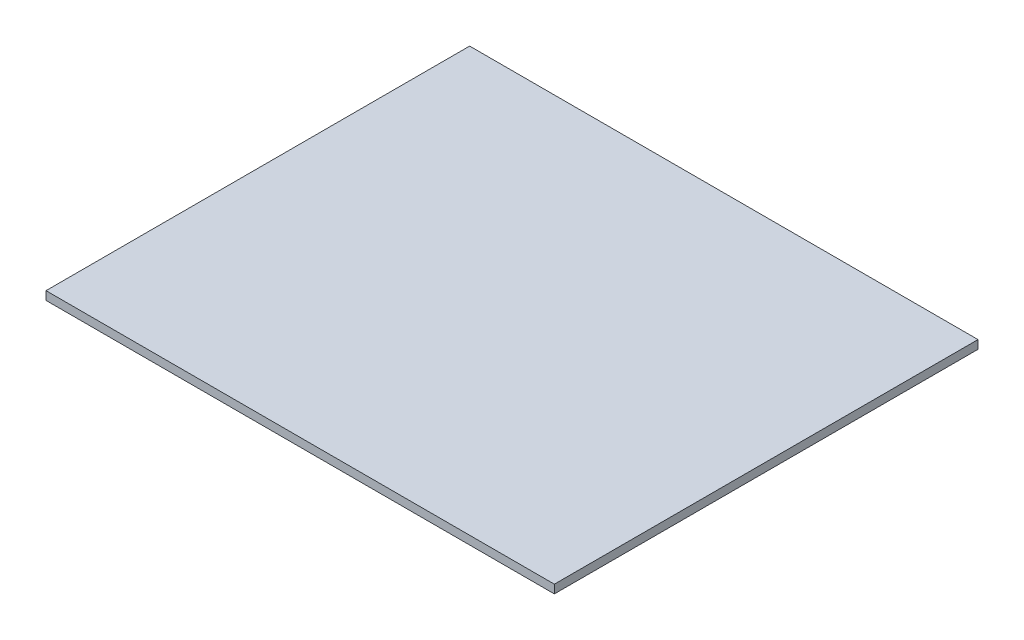
ISO-10303-21;
HEADER;
FILE_DESCRIPTION(('STEP AP214'),'2;1');
FILE_NAME('part.step','',(''),(''),'','','');
FILE_SCHEMA(('AUTOMOTIVE_DESIGN { 1 0 10303 214 1 1 1 1 }'));
ENDSEC;
DATA;
#1=APPLICATION_CONTEXT('core data for automotive mechanical design processes');
#2=APPLICATION_PROTOCOL_DEFINITION('international standard','automotive_design',2000,#1);
#3=PRODUCT_CONTEXT('',#1,'mechanical');
#4=PRODUCT('Part','Part','',(#3));
#5=PRODUCT_RELATED_PRODUCT_CATEGORY('part','',(#4));
#6=PRODUCT_DEFINITION_FORMATION('','',#4);
#7=PRODUCT_DEFINITION_CONTEXT('part definition',#1,'design');
#8=PRODUCT_DEFINITION('design','',#6,#7);
#9=PRODUCT_DEFINITION_SHAPE('','',#8);
#10=(LENGTH_UNIT() NAMED_UNIT(*) SI_UNIT(.MILLI.,.METRE.));
#11=(NAMED_UNIT(*) PLANE_ANGLE_UNIT() SI_UNIT($,.RADIAN.));
#12=(NAMED_UNIT(*) SI_UNIT($,.STERADIAN.) SOLID_ANGLE_UNIT());
#13=UNCERTAINTY_MEASURE_WITH_UNIT(LENGTH_MEASURE(1.E-05),#10,'distance_accuracy_value','');
#14=(GEOMETRIC_REPRESENTATION_CONTEXT(3) GLOBAL_UNCERTAINTY_ASSIGNED_CONTEXT((#13)) GLOBAL_UNIT_ASSIGNED_CONTEXT((#10,
#11,#12)) REPRESENTATION_CONTEXT('',''));
#15=CARTESIAN_POINT('',(0.,0.,0.));
#16=DIRECTION('',(0.,0.,1.));
#17=DIRECTION('',(1.,0.,0.));
#18=AXIS2_PLACEMENT_3D('',#15,#16,#17);
#19=CARTESIAN_POINT('',(0.,20.,1000.));
#20=DIRECTION('',(1.,0.,0.));
#21=DIRECTION('',(0.,0.,-1.));
#22=AXIS2_PLACEMENT_3D('',#19,#20,#21);
#23=PLANE('',#22);
#24=DIRECTION('',(0.,0.,1.));
#25=VECTOR('',#24,1.);
#26=CARTESIAN_POINT('',(0.,0.,1000.));
#27=LINE('',#26,#25);
#28=CARTESIAN_POINT('',(0.,0.,0.));
#29=VERTEX_POINT('',#28);
#30=CARTESIAN_POINT('',(0.,0.,1000.));
#31=VERTEX_POINT('',#30);
#32=EDGE_CURVE('E99',#29,#31,#27,.T.);
#33=ORIENTED_EDGE('',*,*,#32,.T.);
#34=DIRECTION('',(0.,-1.,0.));
#35=VECTOR('',#34,1.);
#36=CARTESIAN_POINT('',(0.,20.,1000.));
#37=LINE('',#36,#35);
#38=CARTESIAN_POINT('',(0.,20.,1000.));
#39=VERTEX_POINT('',#38);
#40=EDGE_CURVE('E11',#39,#31,#37,.T.);
#41=ORIENTED_EDGE('',*,*,#40,.F.);
#42=DIRECTION('',(0.,0.,1.));
#43=VECTOR('',#42,1.);
#44=CARTESIAN_POINT('',(0.,20.,1000.));
#45=LINE('',#44,#43);
#46=CARTESIAN_POINT('',(0.,20.,0.));
#47=VERTEX_POINT('',#46);
#48=EDGE_CURVE('E87',#47,#39,#45,.T.);
#49=ORIENTED_EDGE('',*,*,#48,.F.);
#50=DIRECTION('',(0.,-1.,0.));
#51=VECTOR('',#50,1.);
#52=CARTESIAN_POINT('',(0.,20.,0.));
#53=LINE('',#52,#51);
#54=EDGE_CURVE('E95',#47,#29,#53,.T.);
#55=ORIENTED_EDGE('',*,*,#54,.T.);
#56=EDGE_LOOP('',(#33,#41,#49,#55));
#57=FACE_BOUND('',#56,.T.);
#58=ADVANCED_FACE('F36',(#57),#23,.F.);
#59=CARTESIAN_POINT('',(1200.,20.,1000.));
#60=DIRECTION('',(0.,0.,-1.));
#61=DIRECTION('',(-1.,0.,0.));
#62=AXIS2_PLACEMENT_3D('',#59,#60,#61);
#63=PLANE('',#62);
#64=DIRECTION('',(1.,0.,0.));
#65=VECTOR('',#64,1.);
#66=CARTESIAN_POINT('',(1200.,0.,1000.));
#67=LINE('',#66,#65);
#68=CARTESIAN_POINT('',(1200.,0.,1000.));
#69=VERTEX_POINT('',#68);
#70=EDGE_CURVE('E91',#31,#69,#67,.T.);
#71=ORIENTED_EDGE('',*,*,#70,.T.);
#72=DIRECTION('',(0.,-1.,0.));
#73=VECTOR('',#72,1.);
#74=CARTESIAN_POINT('',(1200.,20.,1000.));
#75=LINE('',#74,#73);
#76=CARTESIAN_POINT('',(1200.,20.,1000.));
#77=VERTEX_POINT('',#76);
#78=EDGE_CURVE('E44',#77,#69,#75,.T.);
#79=ORIENTED_EDGE('',*,*,#78,.F.);
#80=DIRECTION('',(1.,0.,0.));
#81=VECTOR('',#80,1.);
#82=CARTESIAN_POINT('',(1200.,20.,1000.));
#83=LINE('',#82,#81);
#84=EDGE_CURVE('E82',#39,#77,#83,.T.);
#85=ORIENTED_EDGE('',*,*,#84,.F.);
#86=ORIENTED_EDGE('',*,*,#40,.T.);
#87=EDGE_LOOP('',(#71,#79,#85,#86));
#88=FACE_BOUND('',#87,.T.);
#89=ADVANCED_FACE('F90',(#88),#63,.F.);
#90=CARTESIAN_POINT('',(1200.,20.,0.));
#91=DIRECTION('',(-1.,0.,0.));
#92=DIRECTION('',(0.,0.,1.));
#93=AXIS2_PLACEMENT_3D('',#90,#91,#92);
#94=PLANE('',#93);
#95=DIRECTION('',(0.,0.,-1.));
#96=VECTOR('',#95,1.);
#97=CARTESIAN_POINT('',(1200.,0.,0.));
#98=LINE('',#97,#96);
#99=CARTESIAN_POINT('',(1200.,0.,0.));
#100=VERTEX_POINT('',#99);
#101=EDGE_CURVE('E69',#69,#100,#98,.T.);
#102=ORIENTED_EDGE('',*,*,#101,.T.);
#103=DIRECTION('',(0.,-1.,0.));
#104=VECTOR('',#103,1.);
#105=CARTESIAN_POINT('',(1200.,20.,0.));
#106=LINE('',#105,#104);
#107=CARTESIAN_POINT('',(1200.,20.,0.));
#108=VERTEX_POINT('',#107);
#109=EDGE_CURVE('E92',#108,#100,#106,.T.);
#110=ORIENTED_EDGE('',*,*,#109,.F.);
#111=DIRECTION('',(0.,0.,-1.));
#112=VECTOR('',#111,1.);
#113=CARTESIAN_POINT('',(1200.,20.,0.));
#114=LINE('',#113,#112);
#115=EDGE_CURVE('E85',#77,#108,#114,.T.);
#116=ORIENTED_EDGE('',*,*,#115,.F.);
#117=ORIENTED_EDGE('',*,*,#78,.T.);
#118=EDGE_LOOP('',(#102,#110,#116,#117));
#119=FACE_BOUND('',#118,.T.);
#120=ADVANCED_FACE('F93',(#119),#94,.F.);
#121=CARTESIAN_POINT('',(0.,20.,0.));
#122=DIRECTION('',(0.,0.,1.));
#123=DIRECTION('',(1.,0.,0.));
#124=AXIS2_PLACEMENT_3D('',#121,#122,#123);
#125=PLANE('',#124);
#126=DIRECTION('',(-1.,0.,0.));
#127=VECTOR('',#126,1.);
#128=CARTESIAN_POINT('',(0.,0.,0.));
#129=LINE('',#128,#127);
#130=EDGE_CURVE('E75',#100,#29,#129,.T.);
#131=ORIENTED_EDGE('',*,*,#130,.T.);
#132=ORIENTED_EDGE('',*,*,#54,.F.);
#133=DIRECTION('',(-1.,0.,0.));
#134=VECTOR('',#133,1.);
#135=CARTESIAN_POINT('',(0.,20.,0.));
#136=LINE('',#135,#134);
#137=EDGE_CURVE('E52',#108,#47,#136,.T.);
#138=ORIENTED_EDGE('',*,*,#137,.F.);
#139=ORIENTED_EDGE('',*,*,#109,.T.);
#140=EDGE_LOOP('',(#131,#132,#138,#139));
#141=FACE_BOUND('',#140,.T.);
#142=ADVANCED_FACE('F106',(#141),#125,.F.);
#143=CARTESIAN_POINT('',(0.,20.,0.));
#144=DIRECTION('',(0.,-1.,0.));
#145=DIRECTION('',(0.,0.,-1.));
#146=AXIS2_PLACEMENT_3D('',#143,#144,#145);
#147=PLANE('',#146);
#148=ORIENTED_EDGE('',*,*,#48,.T.);
#149=ORIENTED_EDGE('',*,*,#84,.T.);
#150=ORIENTED_EDGE('',*,*,#115,.T.);
#151=ORIENTED_EDGE('',*,*,#137,.T.);
#152=EDGE_LOOP('',(#148,#149,#150,#151));
#153=FACE_BOUND('',#152,.T.);
#154=ADVANCED_FACE('F83',(#153),#147,.F.);
#155=CARTESIAN_POINT('',(0.,0.,0.));
#156=DIRECTION('',(0.,-1.,0.));
#157=DIRECTION('',(0.,0.,-1.));
#158=AXIS2_PLACEMENT_3D('',#155,#156,#157);
#159=PLANE('',#158);
#160=ORIENTED_EDGE('',*,*,#32,.F.);
#161=ORIENTED_EDGE('',*,*,#130,.F.);
#162=ORIENTED_EDGE('',*,*,#101,.F.);
#163=ORIENTED_EDGE('',*,*,#70,.F.);
#164=EDGE_LOOP('',(#160,#161,#162,#163));
#165=FACE_BOUND('',#164,.T.);
#166=ADVANCED_FACE('F109',(#165),#159,.T.);
#167=CLOSED_SHELL('',(#58,#89,#120,#142,#154,#166));
#168=MANIFOLD_SOLID_BREP('B2',#167);
#169=ADVANCED_BREP_SHAPE_REPRESENTATION('',(#18,#168),#14);
#170=SHAPE_DEFINITION_REPRESENTATION(#9,#169);
ENDSEC;
END-ISO-10303-21;
